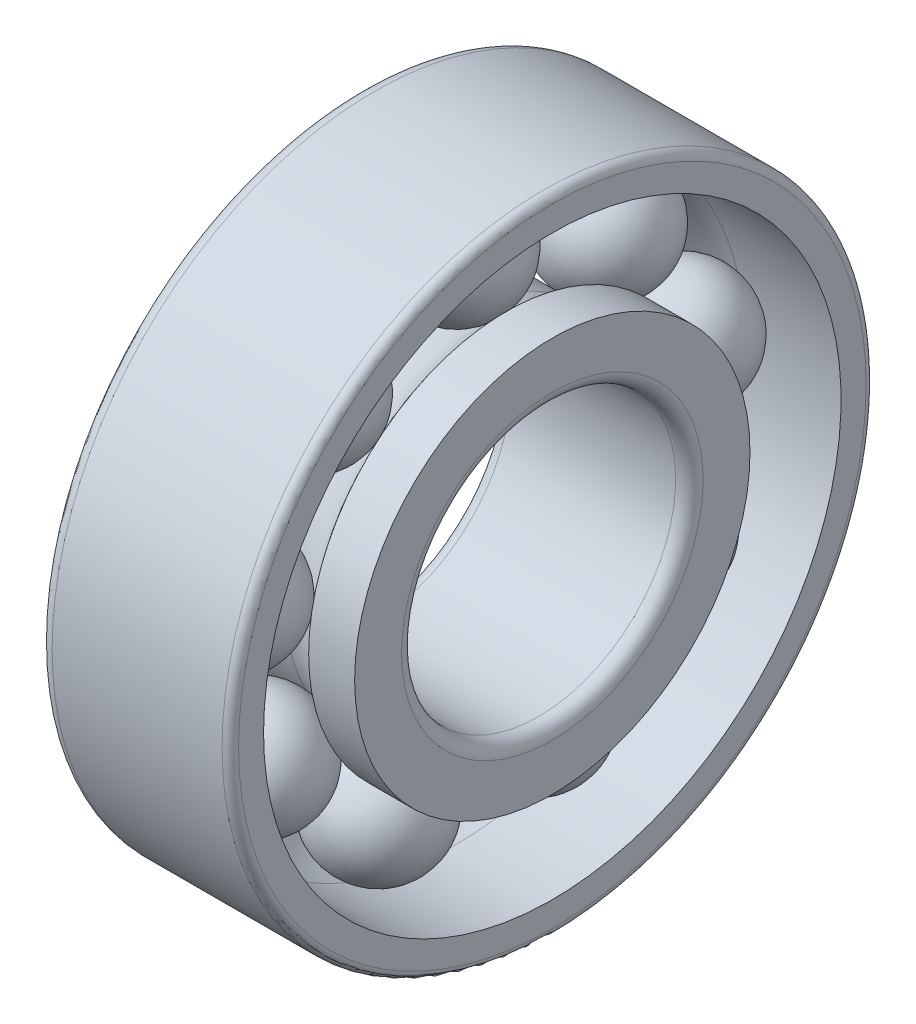
ISO-10303-21;
HEADER;
FILE_DESCRIPTION(('STEP AP214'),'2;1');
FILE_NAME('part.step','',(''),(''),'','','');
FILE_SCHEMA(('AUTOMOTIVE_DESIGN { 1 0 10303 214 1 1 1 1 }'));
ENDSEC;
DATA;
#1=APPLICATION_CONTEXT('core data for automotive mechanical design processes');
#2=APPLICATION_PROTOCOL_DEFINITION('international standard','automotive_design',2000,#1);
#3=PRODUCT_CONTEXT('',#1,'mechanical');
#4=PRODUCT('Part','Part','',(#3));
#5=PRODUCT_RELATED_PRODUCT_CATEGORY('part','',(#4));
#6=PRODUCT_DEFINITION_FORMATION('','',#4);
#7=PRODUCT_DEFINITION_CONTEXT('part definition',#1,'design');
#8=PRODUCT_DEFINITION('design','',#6,#7);
#9=PRODUCT_DEFINITION_SHAPE('','',#8);
#10=(LENGTH_UNIT() NAMED_UNIT(*) SI_UNIT(.MILLI.,.METRE.));
#11=(NAMED_UNIT(*) PLANE_ANGLE_UNIT() SI_UNIT($,.RADIAN.));
#12=(NAMED_UNIT(*) SI_UNIT($,.STERADIAN.) SOLID_ANGLE_UNIT());
#13=UNCERTAINTY_MEASURE_WITH_UNIT(LENGTH_MEASURE(1.E-05),#10,'distance_accuracy_value','');
#14=(GEOMETRIC_REPRESENTATION_CONTEXT(3) GLOBAL_UNCERTAINTY_ASSIGNED_CONTEXT((#13)) GLOBAL_UNIT_ASSIGNED_CONTEXT((#10,
#11,#12)) REPRESENTATION_CONTEXT('',''));
#15=CARTESIAN_POINT('',(0.,0.,0.));
#16=DIRECTION('',(0.,0.,1.));
#17=DIRECTION('',(1.,0.,0.));
#18=AXIS2_PLACEMENT_3D('',#15,#16,#17);
#19=CARTESIAN_POINT('',(-7.00000000000001,23.5,0.));
#20=DIRECTION('',(1.,0.,0.));
#21=DIRECTION('',(0.,0.,-1.));
#22=AXIS2_PLACEMENT_3D('',#19,#20,#21);
#23=PLANE('',#22);
#24=CARTESIAN_POINT('',(-7.00000000000001,0.,0.));
#25=DIRECTION('',(1.,0.,0.));
#26=DIRECTION('',(0.,0.,-1.));
#27=AXIS2_PLACEMENT_3D('',#24,#25,#26);
#28=CIRCLE('',#27,22.5);
#29=CARTESIAN_POINT('',(-7.00000000000001,0.,-22.5));
#30=VERTEX_POINT('',#29);
#31=EDGE_CURVE('P0_E20',#30,#30,#28,.F.);
#32=ORIENTED_EDGE('',*,*,#31,.T.);
#33=EDGE_LOOP('',(#32));
#34=FACE_BOUND('',#33,.T.);
#35=CARTESIAN_POINT('',(-7.00000000000001,0.,0.));
#36=DIRECTION('',(-1.,0.,0.));
#37=DIRECTION('',(0.,0.,1.));
#38=AXIS2_PLACEMENT_3D('',#35,#36,#37);
#39=CIRCLE('',#38,19.074);
#40=CARTESIAN_POINT('',(-7.00000000000001,0.,19.074));
#41=VERTEX_POINT('',#40);
#42=EDGE_CURVE('P0_E33',#41,#41,#39,.T.);
#43=ORIENTED_EDGE('',*,*,#42,.F.);
#44=EDGE_LOOP('',(#43));
#45=FACE_BOUND('',#44,.T.);
#46=ADVANCED_FACE('P0_F14',(#34,#45),#23,.F.);
#47=CARTESIAN_POINT('',(0.,0.,0.));
#48=DIRECTION('',(-1.,0.,0.));
#49=DIRECTION('',(0.,0.,1.));
#50=AXIS2_PLACEMENT_3D('',#47,#48,#49);
#51=CYLINDRICAL_SURFACE('',#50,19.074);
#52=CARTESIAN_POINT('',(-3.64399615806603,0.,0.));
#53=DIRECTION('',(-1.,0.,0.));
#54=DIRECTION('',(0.,0.,1.));
#55=AXIS2_PLACEMENT_3D('',#52,#53,#54);
#56=CIRCLE('',#55,19.074);
#57=CARTESIAN_POINT('',(-3.64399615806603,0.,19.074));
#58=VERTEX_POINT('',#57);
#59=EDGE_CURVE('P0_E36',#58,#58,#56,.T.);
#60=ORIENTED_EDGE('',*,*,#59,.F.);
#61=EDGE_LOOP('',(#60));
#62=FACE_BOUND('',#61,.T.);
#63=ORIENTED_EDGE('',*,*,#42,.T.);
#64=EDGE_LOOP('',(#63));
#65=FACE_BOUND('',#64,.T.);
#66=ADVANCED_FACE('P0_F57',(#62,#65),#51,.F.);
#67=CARTESIAN_POINT('',(0.,0.,0.));
#68=DIRECTION('',(-1.,0.,0.));
#69=DIRECTION('',(0.,0.,1.));
#70=AXIS2_PLACEMENT_3D('',#67,#68,#69);
#71=TOROIDAL_SURFACE('',#70,16.75,4.322);
#72=CARTESIAN_POINT('',(0.,0.,0.));
#73=DIRECTION('',(-1.,0.,0.));
#74=DIRECTION('',(0.,0.,1.));
#75=AXIS2_PLACEMENT_3D('',#72,#73,#74);
#76=CIRCLE('',#75,21.072);
#77=CARTESIAN_POINT('',(0.,0.,21.072));
#78=VERTEX_POINT('',#77);
#79=EDGE_CURVE('P0_E39',#78,#78,#76,.T.);
#80=ORIENTED_EDGE('',*,*,#79,.F.);
#81=EDGE_LOOP('',(#80));
#82=FACE_BOUND('',#81,.T.);
#83=ORIENTED_EDGE('',*,*,#59,.T.);
#84=EDGE_LOOP('',(#83));
#85=FACE_BOUND('',#84,.T.);
#86=ADVANCED_FACE('P0_F51',(#82,#85),#71,.F.);
#87=CARTESIAN_POINT('',(0.,0.,0.));
#88=DIRECTION('',(-1.,0.,0.));
#89=DIRECTION('',(0.,0.,1.));
#90=AXIS2_PLACEMENT_3D('',#87,#88,#89);
#91=CYLINDRICAL_SURFACE('',#90,21.072);
#92=CARTESIAN_POINT('',(7.00000000000001,0.,0.));
#93=DIRECTION('',(-1.,0.,0.));
#94=DIRECTION('',(0.,0.,1.));
#95=AXIS2_PLACEMENT_3D('',#92,#93,#94);
#96=CIRCLE('',#95,21.072);
#97=CARTESIAN_POINT('',(7.00000000000001,0.,21.072));
#98=VERTEX_POINT('',#97);
#99=EDGE_CURVE('P0_E42',#98,#98,#96,.T.);
#100=ORIENTED_EDGE('',*,*,#99,.F.);
#101=EDGE_LOOP('',(#100));
#102=FACE_BOUND('',#101,.T.);
#103=ORIENTED_EDGE('',*,*,#79,.T.);
#104=EDGE_LOOP('',(#103));
#105=FACE_BOUND('',#104,.T.);
#106=ADVANCED_FACE('P0_F48',(#102,#105),#91,.F.);
#107=CARTESIAN_POINT('',(7.00000000000001,23.5,0.));
#108=DIRECTION('',(-1.,0.,0.));
#109=DIRECTION('',(0.,0.,1.));
#110=AXIS2_PLACEMENT_3D('',#107,#108,#109);
#111=PLANE('',#110);
#112=CARTESIAN_POINT('',(7.00000000000001,0.,0.));
#113=DIRECTION('',(-1.,0.,0.));
#114=DIRECTION('',(0.,0.,1.));
#115=AXIS2_PLACEMENT_3D('',#112,#113,#114);
#116=CIRCLE('',#115,22.9);
#117=CARTESIAN_POINT('',(7.00000000000001,0.,22.9));
#118=VERTEX_POINT('',#117);
#119=EDGE_CURVE('P0_E24',#118,#118,#116,.F.);
#120=ORIENTED_EDGE('',*,*,#119,.T.);
#121=EDGE_LOOP('',(#120));
#122=FACE_BOUND('',#121,.T.);
#123=ORIENTED_EDGE('',*,*,#99,.T.);
#124=EDGE_LOOP('',(#123));
#125=FACE_BOUND('',#124,.T.);
#126=ADVANCED_FACE('P0_F46',(#122,#125),#111,.F.);
#127=CARTESIAN_POINT('',(0.,0.,0.));
#128=DIRECTION('',(-1.,0.,0.));
#129=DIRECTION('',(0.,0.,1.));
#130=AXIS2_PLACEMENT_3D('',#127,#128,#129);
#131=CYLINDRICAL_SURFACE('',#130,23.5);
#132=CARTESIAN_POINT('',(-6.00000000000001,0.,0.));
#133=DIRECTION('',(1.,0.,0.));
#134=DIRECTION('',(0.,0.,-1.));
#135=AXIS2_PLACEMENT_3D('',#132,#133,#134);
#136=CIRCLE('',#135,23.5);
#137=CARTESIAN_POINT('',(-6.00000000000001,0.,-23.5));
#138=VERTEX_POINT('',#137);
#139=EDGE_CURVE('P0_E10',#138,#138,#136,.T.);
#140=ORIENTED_EDGE('',*,*,#139,.T.);
#141=EDGE_LOOP('',(#140));
#142=FACE_BOUND('',#141,.T.);
#143=CARTESIAN_POINT('',(6.4,0.,0.));
#144=DIRECTION('',(-1.,0.,0.));
#145=DIRECTION('',(0.,0.,1.));
#146=AXIS2_PLACEMENT_3D('',#143,#144,#145);
#147=CIRCLE('',#146,23.5);
#148=CARTESIAN_POINT('',(6.4,0.,23.5));
#149=VERTEX_POINT('',#148);
#150=EDGE_CURVE('P0_E28',#149,#149,#147,.T.);
#151=ORIENTED_EDGE('',*,*,#150,.T.);
#152=EDGE_LOOP('',(#151));
#153=FACE_BOUND('',#152,.T.);
#154=ADVANCED_FACE('P0_F93',(#142,#153),#131,.T.);
#155=CARTESIAN_POINT('',(6.4,0.,0.));
#156=DIRECTION('',(-1.,0.,0.));
#157=DIRECTION('',(0.,0.,1.));
#158=AXIS2_PLACEMENT_3D('',#155,#156,#157);
#159=TOROIDAL_SURFACE('',#158,22.9,0.6);
#160=ORIENTED_EDGE('',*,*,#119,.F.);
#161=EDGE_LOOP('',(#160));
#162=FACE_BOUND('',#161,.T.);
#163=ORIENTED_EDGE('',*,*,#150,.F.);
#164=EDGE_LOOP('',(#163));
#165=FACE_BOUND('',#164,.T.);
#166=ADVANCED_FACE('P0_F102',(#162,#165),#159,.T.);
#167=CARTESIAN_POINT('',(-6.00000000000001,0.,0.));
#168=DIRECTION('',(1.,0.,0.));
#169=DIRECTION('',(0.,0.,-1.));
#170=AXIS2_PLACEMENT_3D('',#167,#168,#169);
#171=TOROIDAL_SURFACE('',#170,22.5,1.);
#172=ORIENTED_EDGE('',*,*,#139,.F.);
#173=EDGE_LOOP('',(#172));
#174=FACE_BOUND('',#173,.T.);
#175=ORIENTED_EDGE('',*,*,#31,.F.);
#176=EDGE_LOOP('',(#175));
#177=FACE_BOUND('',#176,.T.);
#178=ADVANCED_FACE('P0_F110',(#174,#177),#171,.T.);
#179=CLOSED_SHELL('',(#46,#66,#86,#106,#126,#154,#166,#178));
#180=MANIFOLD_SOLID_BREP('P0_B1',#179);
#181=CARTESIAN_POINT('',(0.,0.,0.));
#182=DIRECTION('',(-1.,0.,0.));
#183=DIRECTION('',(0.,0.,1.));
#184=AXIS2_PLACEMENT_3D('',#181,#182,#183);
#185=CYLINDRICAL_SURFACE('',#184,10.);
#186=CARTESIAN_POINT('',(-6.00000000000001,0.,0.));
#187=DIRECTION('',(1.,0.,0.));
#188=DIRECTION('',(0.,0.,-1.));
#189=AXIS2_PLACEMENT_3D('',#186,#187,#188);
#190=CIRCLE('',#189,10.);
#191=CARTESIAN_POINT('',(-6.00000000000001,0.,-10.));
#192=VERTEX_POINT('',#191);
#193=EDGE_CURVE('P1_E24',#192,#192,#190,.F.);
#194=ORIENTED_EDGE('',*,*,#193,.T.);
#195=EDGE_LOOP('',(#194));
#196=FACE_BOUND('',#195,.T.);
#197=CARTESIAN_POINT('',(6.00000000000001,0.,0.));
#198=DIRECTION('',(-1.,0.,0.));
#199=DIRECTION('',(0.,0.,1.));
#200=AXIS2_PLACEMENT_3D('',#197,#198,#199);
#201=CIRCLE('',#200,10.);
#202=CARTESIAN_POINT('',(6.00000000000001,0.,10.));
#203=VERTEX_POINT('',#202);
#204=EDGE_CURVE('P1_E28',#203,#203,#201,.F.);
#205=ORIENTED_EDGE('',*,*,#204,.T.);
#206=EDGE_LOOP('',(#205));
#207=FACE_BOUND('',#206,.T.);
#208=ADVANCED_FACE('P1_F14',(#196,#207),#185,.F.);
#209=CARTESIAN_POINT('',(7.00000000000001,14.426,0.));
#210=DIRECTION('',(-1.,0.,0.));
#211=DIRECTION('',(0.,0.,1.));
#212=AXIS2_PLACEMENT_3D('',#209,#210,#211);
#213=PLANE('',#212);
#214=CARTESIAN_POINT('',(7.00000000000001,0.,0.));
#215=DIRECTION('',(-1.,0.,0.));
#216=DIRECTION('',(0.,0.,1.));
#217=AXIS2_PLACEMENT_3D('',#214,#215,#216);
#218=CIRCLE('',#217,11.);
#219=CARTESIAN_POINT('',(7.00000000000001,0.,11.));
#220=VERTEX_POINT('',#219);
#221=EDGE_CURVE('P1_E10',#220,#220,#218,.T.);
#222=ORIENTED_EDGE('',*,*,#221,.T.);
#223=EDGE_LOOP('',(#222));
#224=FACE_BOUND('',#223,.T.);
#225=CARTESIAN_POINT('',(7.00000000000001,0.,0.));
#226=DIRECTION('',(-1.,0.,0.));
#227=DIRECTION('',(0.,0.,1.));
#228=AXIS2_PLACEMENT_3D('',#225,#226,#227);
#229=CIRCLE('',#228,14.426);
#230=CARTESIAN_POINT('',(7.00000000000001,0.,14.426));
#231=VERTEX_POINT('',#230);
#232=EDGE_CURVE('P1_E33',#231,#231,#229,.T.);
#233=ORIENTED_EDGE('',*,*,#232,.F.);
#234=EDGE_LOOP('',(#233));
#235=FACE_BOUND('',#234,.T.);
#236=ADVANCED_FACE('P1_F63',(#224,#235),#213,.F.);
#237=CARTESIAN_POINT('',(0.,0.,0.));
#238=DIRECTION('',(-1.,0.,0.));
#239=DIRECTION('',(0.,0.,1.));
#240=AXIS2_PLACEMENT_3D('',#237,#238,#239);
#241=CYLINDRICAL_SURFACE('',#240,14.426);
#242=CARTESIAN_POINT('',(3.64399615806603,0.,0.));
#243=DIRECTION('',(-1.,0.,0.));
#244=DIRECTION('',(0.,0.,1.));
#245=AXIS2_PLACEMENT_3D('',#242,#243,#244);
#246=CIRCLE('',#245,14.426);
#247=CARTESIAN_POINT('',(3.64399615806603,0.,14.426));
#248=VERTEX_POINT('',#247);
#249=EDGE_CURVE('P1_E36',#248,#248,#246,.T.);
#250=ORIENTED_EDGE('',*,*,#249,.F.);
#251=EDGE_LOOP('',(#250));
#252=FACE_BOUND('',#251,.T.);
#253=ORIENTED_EDGE('',*,*,#232,.T.);
#254=EDGE_LOOP('',(#253));
#255=FACE_BOUND('',#254,.T.);
#256=ADVANCED_FACE('P1_F57',(#252,#255),#241,.T.);
#257=CARTESIAN_POINT('',(0.,0.,0.));
#258=DIRECTION('',(-1.,0.,0.));
#259=DIRECTION('',(0.,0.,1.));
#260=AXIS2_PLACEMENT_3D('',#257,#258,#259);
#261=TOROIDAL_SURFACE('',#260,16.75,4.322);
#262=CARTESIAN_POINT('',(0.,0.,0.));
#263=DIRECTION('',(-1.,0.,0.));
#264=DIRECTION('',(0.,0.,1.));
#265=AXIS2_PLACEMENT_3D('',#262,#263,#264);
#266=CIRCLE('',#265,12.428);
#267=CARTESIAN_POINT('',(0.,0.,12.428));
#268=VERTEX_POINT('',#267);
#269=EDGE_CURVE('P1_E39',#268,#268,#266,.T.);
#270=ORIENTED_EDGE('',*,*,#269,.F.);
#271=EDGE_LOOP('',(#270));
#272=FACE_BOUND('',#271,.T.);
#273=ORIENTED_EDGE('',*,*,#249,.T.);
#274=EDGE_LOOP('',(#273));
#275=FACE_BOUND('',#274,.T.);
#276=ADVANCED_FACE('P1_F51',(#272,#275),#261,.F.);
#277=CARTESIAN_POINT('',(0.,0.,0.));
#278=DIRECTION('',(-1.,0.,0.));
#279=DIRECTION('',(0.,0.,1.));
#280=AXIS2_PLACEMENT_3D('',#277,#278,#279);
#281=CYLINDRICAL_SURFACE('',#280,12.428);
#282=CARTESIAN_POINT('',(-7.,0.,0.));
#283=DIRECTION('',(-1.,0.,0.));
#284=DIRECTION('',(0.,0.,1.));
#285=AXIS2_PLACEMENT_3D('',#282,#283,#284);
#286=CIRCLE('',#285,12.428);
#287=CARTESIAN_POINT('',(-7.,0.,12.428));
#288=VERTEX_POINT('',#287);
#289=EDGE_CURVE('P1_E42',#288,#288,#286,.T.);
#290=ORIENTED_EDGE('',*,*,#289,.F.);
#291=EDGE_LOOP('',(#290));
#292=FACE_BOUND('',#291,.T.);
#293=ORIENTED_EDGE('',*,*,#269,.T.);
#294=EDGE_LOOP('',(#293));
#295=FACE_BOUND('',#294,.T.);
#296=ADVANCED_FACE('P1_F48',(#292,#295),#281,.T.);
#297=CARTESIAN_POINT('',(-7.,12.428,0.));
#298=DIRECTION('',(1.,0.,0.));
#299=DIRECTION('',(0.,0.,-1.));
#300=AXIS2_PLACEMENT_3D('',#297,#298,#299);
#301=PLANE('',#300);
#302=CARTESIAN_POINT('',(-7.,0.,0.));
#303=DIRECTION('',(1.,0.,0.));
#304=DIRECTION('',(0.,0.,-1.));
#305=AXIS2_PLACEMENT_3D('',#302,#303,#304);
#306=CIRCLE('',#305,11.);
#307=CARTESIAN_POINT('',(-7.,0.,-11.));
#308=VERTEX_POINT('',#307);
#309=EDGE_CURVE('P1_E20',#308,#308,#306,.T.);
#310=ORIENTED_EDGE('',*,*,#309,.T.);
#311=EDGE_LOOP('',(#310));
#312=FACE_BOUND('',#311,.T.);
#313=ORIENTED_EDGE('',*,*,#289,.T.);
#314=EDGE_LOOP('',(#313));
#315=FACE_BOUND('',#314,.T.);
#316=ADVANCED_FACE('P1_F46',(#312,#315),#301,.F.);
#317=CARTESIAN_POINT('',(-6.00000000000001,0.,0.));
#318=DIRECTION('',(1.,0.,0.));
#319=DIRECTION('',(0.,0.,-1.));
#320=AXIS2_PLACEMENT_3D('',#317,#318,#319);
#321=TOROIDAL_SURFACE('',#320,11.,1.);
#322=ORIENTED_EDGE('',*,*,#309,.F.);
#323=EDGE_LOOP('',(#322));
#324=FACE_BOUND('',#323,.T.);
#325=ORIENTED_EDGE('',*,*,#193,.F.);
#326=EDGE_LOOP('',(#325));
#327=FACE_BOUND('',#326,.T.);
#328=ADVANCED_FACE('P1_F76',(#324,#327),#321,.T.);
#329=CARTESIAN_POINT('',(6.00000000000001,0.,0.));
#330=DIRECTION('',(-1.,0.,0.));
#331=DIRECTION('',(0.,0.,1.));
#332=AXIS2_PLACEMENT_3D('',#329,#330,#331);
#333=TOROIDAL_SURFACE('',#332,11.,1.);
#334=ORIENTED_EDGE('',*,*,#204,.F.);
#335=EDGE_LOOP('',(#334));
#336=FACE_BOUND('',#335,.T.);
#337=ORIENTED_EDGE('',*,*,#221,.F.);
#338=EDGE_LOOP('',(#337));
#339=FACE_BOUND('',#338,.T.);
#340=ADVANCED_FACE('P1_F79',(#336,#339),#333,.T.);
#341=CLOSED_SHELL('',(#208,#236,#256,#276,#296,#316,#328,#340));
#342=MANIFOLD_SOLID_BREP('P1_B1',#341);
#343=CARTESIAN_POINT('',(0.,16.7500000000002,0.));
#344=DIRECTION('',(-1.,0.,0.));
#345=DIRECTION('',(0.,1.00000000000001,0.));
#346=AXIS2_PLACEMENT_3D('',#343,#344,#345);
#347=SPHERICAL_SURFACE('',#346,4.322);
#348=CARTESIAN_POINT('',(-4.32199999999992,16.7500000000002,0.));
#349=VERTEX_POINT('',#348);
#350=VERTEX_LOOP('',#349);
#351=FACE_BOUND('',#350,.T.);
#352=ADVANCED_FACE('P2_F12',(#351),#347,.T.);
#353=CLOSED_SHELL('',(#352));
#354=MANIFOLD_SOLID_BREP('P2_B1',#353);
#355=CARTESIAN_POINT('',(0.,12.831244422243,10.7666924622497));
#356=DIRECTION('',(-1.,0.,0.));
#357=DIRECTION('',(0.,0.766044443118987,0.642787609686551));
#358=AXIS2_PLACEMENT_3D('',#355,#356,#357);
#359=SPHERICAL_SURFACE('',#358,4.322);
#360=CARTESIAN_POINT('',(-4.32199999999992,12.831244422243,10.7666924622497));
#361=VERTEX_POINT('',#360);
#362=VERTEX_LOOP('',#361);
#363=FACE_BOUND('',#362,.T.);
#364=ADVANCED_FACE('P3_F12',(#363),#359,.T.);
#365=CLOSED_SHELL('',(#364));
#366=MANIFOLD_SOLID_BREP('P3_B1',#365);
#367=CARTESIAN_POINT('',(0.,2.90860697592103,16.4955298629547));
#368=DIRECTION('',(-1.,0.,0.));
#369=DIRECTION('',(0.,0.173648177666928,0.984807753012223));
#370=AXIS2_PLACEMENT_3D('',#367,#368,#369);
#371=SPHERICAL_SURFACE('',#370,4.322);
#372=CARTESIAN_POINT('',(-4.32199999999992,2.90860697592103,16.4955298629547));
#373=VERTEX_POINT('',#372);
#374=VERTEX_LOOP('',#373);
#375=FACE_BOUND('',#374,.T.);
#376=ADVANCED_FACE('P4_F12',(#375),#371,.T.);
#377=CLOSED_SHELL('',(#376));
#378=MANIFOLD_SOLID_BREP('P4_B1',#377);
#379=CARTESIAN_POINT('',(0.,-8.37500000000017,14.5059255133894));
#380=DIRECTION('',(-1.,0.,0.));
#381=DIRECTION('',(0.,-0.500000000000013,0.866025403784448));
#382=AXIS2_PLACEMENT_3D('',#379,#380,#381);
#383=SPHERICAL_SURFACE('',#382,4.322);
#384=CARTESIAN_POINT('',(-4.32199999999992,-8.37500000000017,14.5059255133894));
#385=VERTEX_POINT('',#384);
#386=VERTEX_LOOP('',#385);
#387=FACE_BOUND('',#386,.T.);
#388=ADVANCED_FACE('P5_F12',(#387),#383,.T.);
#389=CLOSED_SHELL('',(#388));
#390=MANIFOLD_SOLID_BREP('P5_B1',#389);
#391=CARTESIAN_POINT('',(0.,-15.7398513981642,5.72883740070488));
#392=DIRECTION('',(-1.,0.,0.));
#393=DIRECTION('',(0.,-0.939692620785925,0.342020143325666));
#394=AXIS2_PLACEMENT_3D('',#391,#392,#393);
#395=SPHERICAL_SURFACE('',#394,4.322);
#396=CARTESIAN_POINT('',(-4.32199999999992,-15.7398513981642,5.72883740070488));
#397=VERTEX_POINT('',#396);
#398=VERTEX_LOOP('',#397);
#399=FACE_BOUND('',#398,.T.);
#400=ADVANCED_FACE('P6_F12',(#399),#395,.T.);
#401=CLOSED_SHELL('',(#400));
#402=MANIFOLD_SOLID_BREP('P6_B1',#401);
#403=CARTESIAN_POINT('',(0.,-15.7398513981641,-5.72883740070515));
#404=DIRECTION('',(-1.,0.,0.));
#405=DIRECTION('',(0.,-0.939692620785919,-0.342020143325682));
#406=AXIS2_PLACEMENT_3D('',#403,#404,#405);
#407=SPHERICAL_SURFACE('',#406,4.322);
#408=CARTESIAN_POINT('',(-4.32199999999992,-15.7398513981641,-5.72883740070515));
#409=VERTEX_POINT('',#408);
#410=VERTEX_LOOP('',#409);
#411=FACE_BOUND('',#410,.T.);
#412=ADVANCED_FACE('P7_F12',(#411),#407,.T.);
#413=CLOSED_SHELL('',(#412));
#414=MANIFOLD_SOLID_BREP('P7_B1',#413);
#415=CARTESIAN_POINT('',(0.,-8.37499999999992,-14.5059255133896));
#416=DIRECTION('',(-1.,0.,0.));
#417=DIRECTION('',(0.,-0.499999999999998,-0.866025403784456));
#418=AXIS2_PLACEMENT_3D('',#415,#416,#417);
#419=SPHERICAL_SURFACE('',#418,4.322);
#420=CARTESIAN_POINT('',(-4.32199999999992,-8.37499999999992,-14.5059255133896));
#421=VERTEX_POINT('',#420);
#422=VERTEX_LOOP('',#421);
#423=FACE_BOUND('',#422,.T.);
#424=ADVANCED_FACE('P8_F12',(#423),#419,.T.);
#425=CLOSED_SHELL('',(#424));
#426=MANIFOLD_SOLID_BREP('P8_B1',#425);
#427=CARTESIAN_POINT('',(0.,2.90860697592131,-16.4955298629546));
#428=DIRECTION('',(-1.,0.,0.));
#429=DIRECTION('',(0.,0.173648177666945,-0.98480775301222));
#430=AXIS2_PLACEMENT_3D('',#427,#428,#429);
#431=SPHERICAL_SURFACE('',#430,4.322);
#432=CARTESIAN_POINT('',(-4.32199999999992,2.90860697592131,-16.4955298629546));
#433=VERTEX_POINT('',#432);
#434=VERTEX_LOOP('',#433);
#435=FACE_BOUND('',#434,.T.);
#436=ADVANCED_FACE('P9_F12',(#435),#431,.T.);
#437=CLOSED_SHELL('',(#436));
#438=MANIFOLD_SOLID_BREP('P9_B1',#437);
#439=CARTESIAN_POINT('',(0.,12.8312444222432,-10.7666924622495));
#440=DIRECTION('',(-1.,0.,0.));
#441=DIRECTION('',(0.,0.766044443118998,-0.642787609686538));
#442=AXIS2_PLACEMENT_3D('',#439,#440,#441);
#443=SPHERICAL_SURFACE('',#442,4.322);
#444=CARTESIAN_POINT('',(-4.32199999999992,12.8312444222432,-10.7666924622495));
#445=VERTEX_POINT('',#444);
#446=VERTEX_LOOP('',#445);
#447=FACE_BOUND('',#446,.T.);
#448=ADVANCED_FACE('P10_F12',(#447),#443,.T.);
#449=CLOSED_SHELL('',(#448));
#450=MANIFOLD_SOLID_BREP('P10_B1',#449);
#451=ADVANCED_BREP_SHAPE_REPRESENTATION('',(#18,#180,#342,#354,#366,#378,#390,#402,#414,#426,
#438,#450),#14);
#452=SHAPE_DEFINITION_REPRESENTATION(#9,#451);
ENDSEC;
END-ISO-10303-21;
